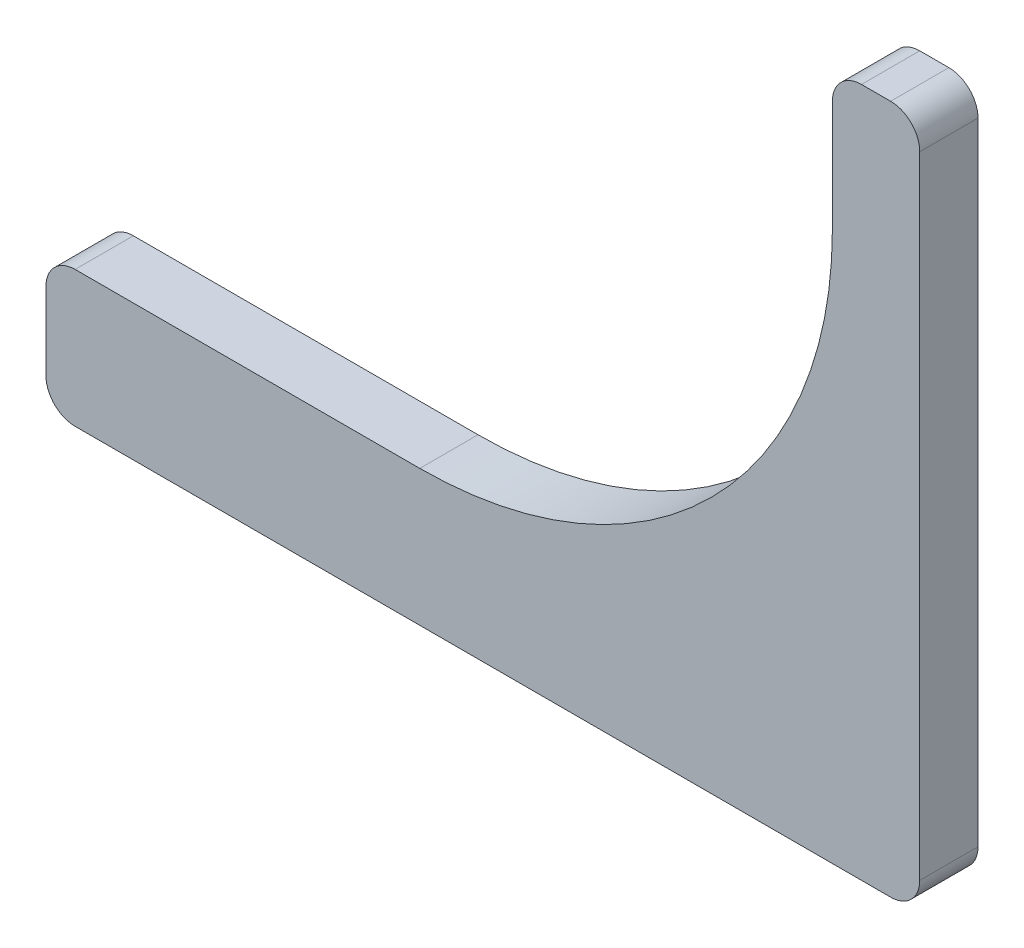
ISO-10303-21;
HEADER;
FILE_DESCRIPTION(('STEP AP214'),'2;1');
FILE_NAME('part.step','',(''),(''),'','','');
FILE_SCHEMA(('AUTOMOTIVE_DESIGN { 1 0 10303 214 1 1 1 1 }'));
ENDSEC;
DATA;
#1=APPLICATION_CONTEXT('core data for automotive mechanical design processes');
#2=APPLICATION_PROTOCOL_DEFINITION('international standard','automotive_design',2000,#1);
#3=PRODUCT_CONTEXT('',#1,'mechanical');
#4=PRODUCT('Part','Part','',(#3));
#5=PRODUCT_RELATED_PRODUCT_CATEGORY('part','',(#4));
#6=PRODUCT_DEFINITION_FORMATION('','',#4);
#7=PRODUCT_DEFINITION_CONTEXT('part definition',#1,'design');
#8=PRODUCT_DEFINITION('design','',#6,#7);
#9=PRODUCT_DEFINITION_SHAPE('','',#8);
#10=(LENGTH_UNIT() NAMED_UNIT(*) SI_UNIT(.MILLI.,.METRE.));
#11=(NAMED_UNIT(*) PLANE_ANGLE_UNIT() SI_UNIT($,.RADIAN.));
#12=(NAMED_UNIT(*) SI_UNIT($,.STERADIAN.) SOLID_ANGLE_UNIT());
#13=UNCERTAINTY_MEASURE_WITH_UNIT(LENGTH_MEASURE(1.E-05),#10,'distance_accuracy_value','');
#14=(GEOMETRIC_REPRESENTATION_CONTEXT(3) GLOBAL_UNCERTAINTY_ASSIGNED_CONTEXT((#13)) GLOBAL_UNIT_ASSIGNED_CONTEXT((#10,
#11,#12)) REPRESENTATION_CONTEXT('',''));
#15=CARTESIAN_POINT('',(0.,0.,0.));
#16=DIRECTION('',(0.,0.,1.));
#17=DIRECTION('',(1.,0.,0.));
#18=AXIS2_PLACEMENT_3D('',#15,#16,#17);
#19=CARTESIAN_POINT('',(0.,0.,6.00000000000001));
#20=DIRECTION('',(0.,0.,-1.));
#21=DIRECTION('',(-1.,0.,0.));
#22=AXIS2_PLACEMENT_3D('',#19,#20,#21);
#23=CYLINDRICAL_SURFACE('',#22,42.5);
#24=CARTESIAN_POINT('',(0.,0.,0.));
#25=DIRECTION('',(0.,0.,-1.));
#26=DIRECTION('',(-1.,0.,0.));
#27=AXIS2_PLACEMENT_3D('',#24,#25,#26);
#28=CIRCLE('',#27,42.5);
#29=CARTESIAN_POINT('',(42.5,0.,0.));
#30=VERTEX_POINT('',#29);
#31=CARTESIAN_POINT('',(0.,-42.5,0.));
#32=VERTEX_POINT('',#31);
#33=EDGE_CURVE('E159',#30,#32,#28,.T.);
#34=ORIENTED_EDGE('',*,*,#33,.T.);
#35=DIRECTION('',(0.,0.,-1.));
#36=VECTOR('',#35,1.);
#37=CARTESIAN_POINT('',(0.,-42.5,6.00000000000001));
#38=LINE('',#37,#36);
#39=CARTESIAN_POINT('',(0.,-42.5,6.00000000000001));
#40=VERTEX_POINT('',#39);
#41=EDGE_CURVE('E11',#40,#32,#38,.T.);
#42=ORIENTED_EDGE('',*,*,#41,.F.);
#43=CARTESIAN_POINT('',(0.,0.,6.00000000000001));
#44=DIRECTION('',(0.,0.,-1.));
#45=DIRECTION('',(-1.,0.,0.));
#46=AXIS2_PLACEMENT_3D('',#43,#44,#45);
#47=CIRCLE('',#46,42.5);
#48=CARTESIAN_POINT('',(42.5,0.,6.00000000000001));
#49=VERTEX_POINT('',#48);
#50=EDGE_CURVE('E181',#49,#40,#47,.T.);
#51=ORIENTED_EDGE('',*,*,#50,.F.);
#52=DIRECTION('',(0.,0.,-1.));
#53=VECTOR('',#52,1.);
#54=CARTESIAN_POINT('',(42.5,0.,6.00000000000001));
#55=LINE('',#54,#53);
#56=EDGE_CURVE('E155',#49,#30,#55,.T.);
#57=ORIENTED_EDGE('',*,*,#56,.T.);
#58=EDGE_LOOP('',(#34,#42,#51,#57));
#59=FACE_BOUND('',#58,.T.);
#60=ADVANCED_FACE('F39',(#59),#23,.F.);
#61=CARTESIAN_POINT('',(0.,-42.5,6.00000000000001));
#62=DIRECTION('',(0.,-1.,0.));
#63=DIRECTION('',(1.,0.,0.));
#64=AXIS2_PLACEMENT_3D('',#61,#62,#63);
#65=PLANE('',#64);
#66=DIRECTION('',(-1.,0.,0.));
#67=VECTOR('',#66,1.);
#68=CARTESIAN_POINT('',(0.,-42.5,0.));
#69=LINE('',#68,#67);
#70=CARTESIAN_POINT('',(-35.5,-42.5,0.));
#71=VERTEX_POINT('',#70);
#72=EDGE_CURVE('E162',#32,#71,#69,.T.);
#73=ORIENTED_EDGE('',*,*,#72,.T.);
#74=DIRECTION('',(0.,0.,-1.));
#75=VECTOR('',#74,1.);
#76=CARTESIAN_POINT('',(-35.5,-42.5,6.00000000000001));
#77=LINE('',#76,#75);
#78=CARTESIAN_POINT('',(-35.5,-42.5,6.00000000000001));
#79=VERTEX_POINT('',#78);
#80=EDGE_CURVE('E47',#79,#71,#77,.T.);
#81=ORIENTED_EDGE('',*,*,#80,.F.);
#82=DIRECTION('',(-1.,0.,0.));
#83=VECTOR('',#82,1.);
#84=CARTESIAN_POINT('',(0.,-42.5,6.00000000000001));
#85=LINE('',#84,#83);
#86=EDGE_CURVE('E110',#40,#79,#85,.T.);
#87=ORIENTED_EDGE('',*,*,#86,.F.);
#88=ORIENTED_EDGE('',*,*,#41,.T.);
#89=EDGE_LOOP('',(#73,#81,#87,#88));
#90=FACE_BOUND('',#89,.T.);
#91=ADVANCED_FACE('F259',(#90),#65,.F.);
#92=CARTESIAN_POINT('',(-35.5,-45.5,6.00000000000001));
#93=DIRECTION('',(0.,0.,-1.));
#94=DIRECTION('',(-1.,0.,0.));
#95=AXIS2_PLACEMENT_3D('',#92,#93,#94);
#96=CYLINDRICAL_SURFACE('',#95,3.);
#97=CARTESIAN_POINT('',(-35.5,-45.5,0.));
#98=DIRECTION('',(0.,0.,1.));
#99=DIRECTION('',(1.,0.,0.));
#100=AXIS2_PLACEMENT_3D('',#97,#98,#99);
#101=CIRCLE('',#100,3.);
#102=CARTESIAN_POINT('',(-38.5,-45.5,0.));
#103=VERTEX_POINT('',#102);
#104=EDGE_CURVE('E164',#71,#103,#101,.T.);
#105=ORIENTED_EDGE('',*,*,#104,.T.);
#106=DIRECTION('',(0.,0.,-1.));
#107=VECTOR('',#106,1.);
#108=CARTESIAN_POINT('',(-38.5,-45.5,5.99999999999995));
#109=LINE('',#108,#107);
#110=CARTESIAN_POINT('',(-38.5,-45.5,5.99999999999995));
#111=VERTEX_POINT('',#110);
#112=EDGE_CURVE('E200',#111,#103,#109,.T.);
#113=ORIENTED_EDGE('',*,*,#112,.F.);
#114=CARTESIAN_POINT('',(-35.5,-45.5,6.00000000000001));
#115=DIRECTION('',(0.,0.,1.));
#116=DIRECTION('',(1.,0.,0.));
#117=AXIS2_PLACEMENT_3D('',#114,#115,#116);
#118=CIRCLE('',#117,3.);
#119=EDGE_CURVE('E208',#79,#111,#118,.T.);
#120=ORIENTED_EDGE('',*,*,#119,.F.);
#121=ORIENTED_EDGE('',*,*,#80,.T.);
#122=EDGE_LOOP('',(#105,#113,#120,#121));
#123=FACE_BOUND('',#122,.T.);
#124=ADVANCED_FACE('F206',(#123),#96,.T.);
#125=CARTESIAN_POINT('',(-38.5,-45.5,5.99999999999995));
#126=DIRECTION('',(1.,0.,0.));
#127=DIRECTION('',(0.,1.,0.));
#128=AXIS2_PLACEMENT_3D('',#125,#126,#127);
#129=PLANE('',#128);
#130=DIRECTION('',(0.,-1.,0.));
#131=VECTOR('',#130,1.);
#132=CARTESIAN_POINT('',(-38.5,-45.5,0.));
#133=LINE('',#132,#131);
#134=CARTESIAN_POINT('',(-38.5,-53.5,0.));
#135=VERTEX_POINT('',#134);
#136=EDGE_CURVE('E166',#103,#135,#133,.T.);
#137=ORIENTED_EDGE('',*,*,#136,.T.);
#138=DIRECTION('',(0.,0.,-1.));
#139=VECTOR('',#138,1.);
#140=CARTESIAN_POINT('',(-38.5,-53.5,5.99999999999995));
#141=LINE('',#140,#139);
#142=CARTESIAN_POINT('',(-38.5,-53.5,5.99999999999995));
#143=VERTEX_POINT('',#142);
#144=EDGE_CURVE('E197',#143,#135,#141,.T.);
#145=ORIENTED_EDGE('',*,*,#144,.F.);
#146=DIRECTION('',(0.,-1.,0.));
#147=VECTOR('',#146,1.);
#148=CARTESIAN_POINT('',(-38.5,-45.5,5.99999999999995));
#149=LINE('',#148,#147);
#150=EDGE_CURVE('E226',#111,#143,#149,.T.);
#151=ORIENTED_EDGE('',*,*,#150,.F.);
#152=ORIENTED_EDGE('',*,*,#112,.T.);
#153=EDGE_LOOP('',(#137,#145,#151,#152));
#154=FACE_BOUND('',#153,.T.);
#155=ADVANCED_FACE('F217',(#154),#129,.F.);
#156=CARTESIAN_POINT('',(-35.5,-53.5,5.99999999999995));
#157=DIRECTION('',(0.,0.,-1.));
#158=DIRECTION('',(-1.,0.,0.));
#159=AXIS2_PLACEMENT_3D('',#156,#157,#158);
#160=CYLINDRICAL_SURFACE('',#159,3.);
#161=CARTESIAN_POINT('',(-35.5,-53.5,0.));
#162=DIRECTION('',(0.,0.,1.));
#163=DIRECTION('',(-1.,0.,0.));
#164=AXIS2_PLACEMENT_3D('',#161,#162,#163);
#165=CIRCLE('',#164,3.);
#166=CARTESIAN_POINT('',(-35.5,-56.5,0.));
#167=VERTEX_POINT('',#166);
#168=EDGE_CURVE('E168',#135,#167,#165,.T.);
#169=ORIENTED_EDGE('',*,*,#168,.T.);
#170=DIRECTION('',(0.,0.,-1.));
#171=VECTOR('',#170,1.);
#172=CARTESIAN_POINT('',(-35.5,-56.5,5.99999999999995));
#173=LINE('',#172,#171);
#174=CARTESIAN_POINT('',(-35.5,-56.5,5.99999999999995));
#175=VERTEX_POINT('',#174);
#176=EDGE_CURVE('E194',#175,#167,#173,.T.);
#177=ORIENTED_EDGE('',*,*,#176,.F.);
#178=CARTESIAN_POINT('',(-35.5,-53.5,5.99999999999995));
#179=DIRECTION('',(0.,0.,1.));
#180=DIRECTION('',(-1.,0.,0.));
#181=AXIS2_PLACEMENT_3D('',#178,#179,#180);
#182=CIRCLE('',#181,3.);
#183=EDGE_CURVE('E223',#143,#175,#182,.T.);
#184=ORIENTED_EDGE('',*,*,#183,.F.);
#185=ORIENTED_EDGE('',*,*,#144,.T.);
#186=EDGE_LOOP('',(#169,#177,#184,#185));
#187=FACE_BOUND('',#186,.T.);
#188=ADVANCED_FACE('F221',(#187),#160,.T.);
#189=CARTESIAN_POINT('',(-35.5,-56.5,5.99999999999995));
#190=DIRECTION('',(0.,1.,0.));
#191=DIRECTION('',(0.,0.,1.));
#192=AXIS2_PLACEMENT_3D('',#189,#190,#191);
#193=PLANE('',#192);
#194=DIRECTION('',(1.,0.,0.));
#195=VECTOR('',#194,1.);
#196=CARTESIAN_POINT('',(-35.5,-56.5,0.));
#197=LINE('',#196,#195);
#198=CARTESIAN_POINT('',(48.5,-56.5,0.));
#199=VERTEX_POINT('',#198);
#200=EDGE_CURVE('E170',#167,#199,#197,.T.);
#201=ORIENTED_EDGE('',*,*,#200,.T.);
#202=DIRECTION('',(0.,0.,-1.));
#203=VECTOR('',#202,1.);
#204=CARTESIAN_POINT('',(48.5,-56.5,6.00000000000001));
#205=LINE('',#204,#203);
#206=CARTESIAN_POINT('',(48.5,-56.5,6.00000000000001));
#207=VERTEX_POINT('',#206);
#208=EDGE_CURVE('E191',#207,#199,#205,.T.);
#209=ORIENTED_EDGE('',*,*,#208,.F.);
#210=DIRECTION('',(1.,0.,0.));
#211=VECTOR('',#210,1.);
#212=CARTESIAN_POINT('',(-35.5,-56.5,5.99999999999995));
#213=LINE('',#212,#211);
#214=EDGE_CURVE('E225',#175,#207,#213,.T.);
#215=ORIENTED_EDGE('',*,*,#214,.F.);
#216=ORIENTED_EDGE('',*,*,#176,.T.);
#217=EDGE_LOOP('',(#201,#209,#215,#216));
#218=FACE_BOUND('',#217,.T.);
#219=ADVANCED_FACE('F272',(#218),#193,.F.);
#220=CARTESIAN_POINT('',(48.5,-53.5,6.00000000000001));
#221=DIRECTION('',(0.,0.,-1.));
#222=DIRECTION('',(-1.,0.,0.));
#223=AXIS2_PLACEMENT_3D('',#220,#221,#222);
#224=CYLINDRICAL_SURFACE('',#223,3.);
#225=CARTESIAN_POINT('',(48.5,-53.5,0.));
#226=DIRECTION('',(0.,0.,1.));
#227=DIRECTION('',(1.,0.,0.));
#228=AXIS2_PLACEMENT_3D('',#225,#226,#227);
#229=CIRCLE('',#228,3.);
#230=CARTESIAN_POINT('',(51.5,-53.5,0.));
#231=VERTEX_POINT('',#230);
#232=EDGE_CURVE('E172',#199,#231,#229,.T.);
#233=ORIENTED_EDGE('',*,*,#232,.T.);
#234=DIRECTION('',(0.,0.,-1.));
#235=VECTOR('',#234,1.);
#236=CARTESIAN_POINT('',(51.5,-53.5,5.99999999999995));
#237=LINE('',#236,#235);
#238=CARTESIAN_POINT('',(51.5,-53.5,5.99999999999995));
#239=VERTEX_POINT('',#238);
#240=EDGE_CURVE('E188',#239,#231,#237,.T.);
#241=ORIENTED_EDGE('',*,*,#240,.F.);
#242=CARTESIAN_POINT('',(48.5,-53.5,6.00000000000001));
#243=DIRECTION('',(0.,0.,1.));
#244=DIRECTION('',(1.,0.,0.));
#245=AXIS2_PLACEMENT_3D('',#242,#243,#244);
#246=CIRCLE('',#245,3.);
#247=EDGE_CURVE('E228',#207,#239,#246,.T.);
#248=ORIENTED_EDGE('',*,*,#247,.F.);
#249=ORIENTED_EDGE('',*,*,#208,.T.);
#250=EDGE_LOOP('',(#233,#241,#248,#249));
#251=FACE_BOUND('',#250,.T.);
#252=ADVANCED_FACE('F275',(#251),#224,.T.);
#253=CARTESIAN_POINT('',(51.5,-53.5,5.99999999999995));
#254=DIRECTION('',(-1.,0.,0.));
#255=DIRECTION('',(0.,-1.,0.));
#256=AXIS2_PLACEMENT_3D('',#253,#254,#255);
#257=PLANE('',#256);
#258=DIRECTION('',(0.,1.,0.));
#259=VECTOR('',#258,1.);
#260=CARTESIAN_POINT('',(51.5,-53.5,0.));
#261=LINE('',#260,#259);
#262=CARTESIAN_POINT('',(51.5,11.5,0.));
#263=VERTEX_POINT('',#262);
#264=EDGE_CURVE('E174',#231,#263,#261,.T.);
#265=ORIENTED_EDGE('',*,*,#264,.T.);
#266=DIRECTION('',(0.,0.,-1.));
#267=VECTOR('',#266,1.);
#268=CARTESIAN_POINT('',(51.5,11.5,5.99999999999995));
#269=LINE('',#268,#267);
#270=CARTESIAN_POINT('',(51.5,11.5,5.99999999999995));
#271=VERTEX_POINT('',#270);
#272=EDGE_CURVE('E185',#271,#263,#269,.T.);
#273=ORIENTED_EDGE('',*,*,#272,.F.);
#274=DIRECTION('',(0.,1.,0.));
#275=VECTOR('',#274,1.);
#276=CARTESIAN_POINT('',(51.5,-53.5,5.99999999999995));
#277=LINE('',#276,#275);
#278=EDGE_CURVE('E234',#239,#271,#277,.T.);
#279=ORIENTED_EDGE('',*,*,#278,.F.);
#280=ORIENTED_EDGE('',*,*,#240,.T.);
#281=EDGE_LOOP('',(#265,#273,#279,#280));
#282=FACE_BOUND('',#281,.T.);
#283=ADVANCED_FACE('F240',(#282),#257,.F.);
#284=CARTESIAN_POINT('',(48.5,11.5,5.99999999999995));
#285=DIRECTION('',(0.,0.,-1.));
#286=DIRECTION('',(-1.,0.,0.));
#287=AXIS2_PLACEMENT_3D('',#284,#285,#286);
#288=CYLINDRICAL_SURFACE('',#287,3.);
#289=CARTESIAN_POINT('',(48.5,11.5,0.));
#290=DIRECTION('',(0.,0.,1.));
#291=DIRECTION('',(1.,0.,0.));
#292=AXIS2_PLACEMENT_3D('',#289,#290,#291);
#293=CIRCLE('',#292,3.);
#294=CARTESIAN_POINT('',(48.5,14.5,0.));
#295=VERTEX_POINT('',#294);
#296=EDGE_CURVE('E176',#263,#295,#293,.T.);
#297=ORIENTED_EDGE('',*,*,#296,.T.);
#298=DIRECTION('',(0.,0.,-1.));
#299=VECTOR('',#298,1.);
#300=CARTESIAN_POINT('',(48.5,14.5,6.00000000000001));
#301=LINE('',#300,#299);
#302=CARTESIAN_POINT('',(48.5,14.5,6.00000000000001));
#303=VERTEX_POINT('',#302);
#304=EDGE_CURVE('E150',#303,#295,#301,.T.);
#305=ORIENTED_EDGE('',*,*,#304,.F.);
#306=CARTESIAN_POINT('',(48.5,11.5,5.99999999999995));
#307=DIRECTION('',(0.,0.,1.));
#308=DIRECTION('',(1.,0.,0.));
#309=AXIS2_PLACEMENT_3D('',#306,#307,#308);
#310=CIRCLE('',#309,3.);
#311=EDGE_CURVE('E141',#271,#303,#310,.T.);
#312=ORIENTED_EDGE('',*,*,#311,.F.);
#313=ORIENTED_EDGE('',*,*,#272,.T.);
#314=EDGE_LOOP('',(#297,#305,#312,#313));
#315=FACE_BOUND('',#314,.T.);
#316=ADVANCED_FACE('F244',(#315),#288,.T.);
#317=CARTESIAN_POINT('',(48.5,14.5,6.00000000000001));
#318=DIRECTION('',(0.,-1.,0.));
#319=DIRECTION('',(1.,0.,0.));
#320=AXIS2_PLACEMENT_3D('',#317,#318,#319);
#321=PLANE('',#320);
#322=DIRECTION('',(-1.,0.,0.));
#323=VECTOR('',#322,1.);
#324=CARTESIAN_POINT('',(48.5,14.5,0.));
#325=LINE('',#324,#323);
#326=CARTESIAN_POINT('',(45.5,14.5,0.));
#327=VERTEX_POINT('',#326);
#328=EDGE_CURVE('E149',#295,#327,#325,.T.);
#329=ORIENTED_EDGE('',*,*,#328,.T.);
#330=DIRECTION('',(0.,0.,-1.));
#331=VECTOR('',#330,1.);
#332=CARTESIAN_POINT('',(45.5,14.5,5.99999999999995));
#333=LINE('',#332,#331);
#334=CARTESIAN_POINT('',(45.5,14.5,5.99999999999995));
#335=VERTEX_POINT('',#334);
#336=EDGE_CURVE('E146',#335,#327,#333,.T.);
#337=ORIENTED_EDGE('',*,*,#336,.F.);
#338=DIRECTION('',(-1.,0.,0.));
#339=VECTOR('',#338,1.);
#340=CARTESIAN_POINT('',(48.5,14.5,6.00000000000001));
#341=LINE('',#340,#339);
#342=EDGE_CURVE('E135',#303,#335,#341,.T.);
#343=ORIENTED_EDGE('',*,*,#342,.F.);
#344=ORIENTED_EDGE('',*,*,#304,.T.);
#345=EDGE_LOOP('',(#329,#337,#343,#344));
#346=FACE_BOUND('',#345,.T.);
#347=ADVANCED_FACE('F147',(#346),#321,.F.);
#348=CARTESIAN_POINT('',(45.5,11.5,5.99999999999995));
#349=DIRECTION('',(0.,0.,-1.));
#350=DIRECTION('',(-1.,0.,0.));
#351=AXIS2_PLACEMENT_3D('',#348,#349,#350);
#352=CYLINDRICAL_SURFACE('',#351,3.);
#353=CARTESIAN_POINT('',(45.5,11.5,0.));
#354=DIRECTION('',(0.,0.,1.));
#355=DIRECTION('',(1.,0.,0.));
#356=AXIS2_PLACEMENT_3D('',#353,#354,#355);
#357=CIRCLE('',#356,3.);
#358=CARTESIAN_POINT('',(42.5,11.5,0.));
#359=VERTEX_POINT('',#358);
#360=EDGE_CURVE('E96',#327,#359,#357,.T.);
#361=ORIENTED_EDGE('',*,*,#360,.T.);
#362=DIRECTION('',(0.,0.,-1.));
#363=VECTOR('',#362,1.);
#364=CARTESIAN_POINT('',(42.5,11.5,5.99999999999995));
#365=LINE('',#364,#363);
#366=CARTESIAN_POINT('',(42.5,11.5,5.99999999999995));
#367=VERTEX_POINT('',#366);
#368=EDGE_CURVE('E151',#367,#359,#365,.T.);
#369=ORIENTED_EDGE('',*,*,#368,.F.);
#370=CARTESIAN_POINT('',(45.5,11.5,5.99999999999995));
#371=DIRECTION('',(0.,0.,1.));
#372=DIRECTION('',(1.,0.,0.));
#373=AXIS2_PLACEMENT_3D('',#370,#371,#372);
#374=CIRCLE('',#373,3.);
#375=EDGE_CURVE('E139',#335,#367,#374,.T.);
#376=ORIENTED_EDGE('',*,*,#375,.F.);
#377=ORIENTED_EDGE('',*,*,#336,.T.);
#378=EDGE_LOOP('',(#361,#369,#376,#377));
#379=FACE_BOUND('',#378,.T.);
#380=ADVANCED_FACE('F153',(#379),#352,.T.);
#381=CARTESIAN_POINT('',(42.5,11.5,5.99999999999995));
#382=DIRECTION('',(1.,0.,0.));
#383=DIRECTION('',(0.,1.,0.));
#384=AXIS2_PLACEMENT_3D('',#381,#382,#383);
#385=PLANE('',#384);
#386=DIRECTION('',(0.,-1.,0.));
#387=VECTOR('',#386,1.);
#388=CARTESIAN_POINT('',(42.5,11.5,0.));
#389=LINE('',#388,#387);
#390=EDGE_CURVE('E102',#359,#30,#389,.T.);
#391=ORIENTED_EDGE('',*,*,#390,.T.);
#392=ORIENTED_EDGE('',*,*,#56,.F.);
#393=DIRECTION('',(0.,-1.,0.));
#394=VECTOR('',#393,1.);
#395=CARTESIAN_POINT('',(42.5,11.5,5.99999999999995));
#396=LINE('',#395,#394);
#397=EDGE_CURVE('E55',#367,#49,#396,.T.);
#398=ORIENTED_EDGE('',*,*,#397,.F.);
#399=ORIENTED_EDGE('',*,*,#368,.T.);
#400=EDGE_LOOP('',(#391,#392,#398,#399));
#401=FACE_BOUND('',#400,.T.);
#402=ADVANCED_FACE('F248',(#401),#385,.F.);
#403=CARTESIAN_POINT('',(0.,0.,6.00000000000001));
#404=DIRECTION('',(0.,0.,-1.));
#405=DIRECTION('',(-1.,0.,0.));
#406=AXIS2_PLACEMENT_3D('',#403,#404,#405);
#407=PLANE('',#406);
#408=ORIENTED_EDGE('',*,*,#50,.T.);
#409=ORIENTED_EDGE('',*,*,#86,.T.);
#410=ORIENTED_EDGE('',*,*,#119,.T.);
#411=ORIENTED_EDGE('',*,*,#150,.T.);
#412=ORIENTED_EDGE('',*,*,#183,.T.);
#413=ORIENTED_EDGE('',*,*,#214,.T.);
#414=ORIENTED_EDGE('',*,*,#247,.T.);
#415=ORIENTED_EDGE('',*,*,#278,.T.);
#416=ORIENTED_EDGE('',*,*,#311,.T.);
#417=ORIENTED_EDGE('',*,*,#342,.T.);
#418=ORIENTED_EDGE('',*,*,#375,.T.);
#419=ORIENTED_EDGE('',*,*,#397,.T.);
#420=EDGE_LOOP('',(#408,#409,#410,#411,#412,#413,#414,#415,#416,#417,#418,#419));
#421=FACE_BOUND('',#420,.T.);
#422=ADVANCED_FACE('F137',(#421),#407,.F.);
#423=CARTESIAN_POINT('',(0.,0.,0.));
#424=DIRECTION('',(0.,0.,-1.));
#425=DIRECTION('',(-1.,0.,0.));
#426=AXIS2_PLACEMENT_3D('',#423,#424,#425);
#427=PLANE('',#426);
#428=ORIENTED_EDGE('',*,*,#33,.F.);
#429=ORIENTED_EDGE('',*,*,#390,.F.);
#430=ORIENTED_EDGE('',*,*,#360,.F.);
#431=ORIENTED_EDGE('',*,*,#328,.F.);
#432=ORIENTED_EDGE('',*,*,#296,.F.);
#433=ORIENTED_EDGE('',*,*,#264,.F.);
#434=ORIENTED_EDGE('',*,*,#232,.F.);
#435=ORIENTED_EDGE('',*,*,#200,.F.);
#436=ORIENTED_EDGE('',*,*,#168,.F.);
#437=ORIENTED_EDGE('',*,*,#136,.F.);
#438=ORIENTED_EDGE('',*,*,#104,.F.);
#439=ORIENTED_EDGE('',*,*,#72,.F.);
#440=EDGE_LOOP('',(#428,#429,#430,#431,#432,#433,#434,#435,#436,#437,#438,#439));
#441=FACE_BOUND('',#440,.T.);
#442=ADVANCED_FACE('F212',(#441),#427,.T.);
#443=CLOSED_SHELL('',(#60,#91,#124,#155,#188,#219,#252,#283,#316,#347,#380,#402,#422,#442));
#444=MANIFOLD_SOLID_BREP('B2',#443);
#445=ADVANCED_BREP_SHAPE_REPRESENTATION('',(#18,#444),#14);
#446=SHAPE_DEFINITION_REPRESENTATION(#9,#445);
ENDSEC;
END-ISO-10303-21;
